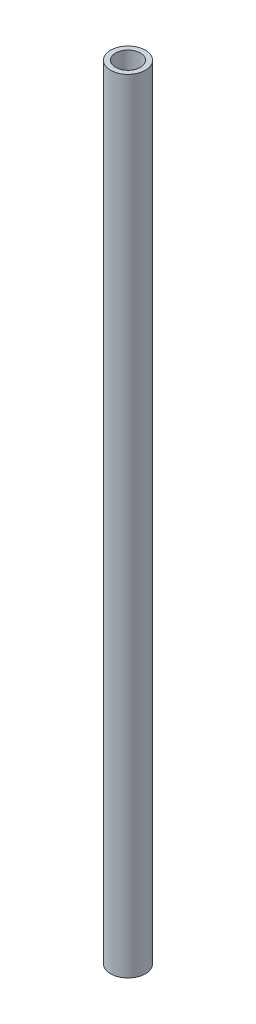
ISO-10303-21;
HEADER;
FILE_DESCRIPTION(('STEP AP214'),'2;1');
FILE_NAME('part.step','',(''),(''),'','','');
FILE_SCHEMA(('AUTOMOTIVE_DESIGN { 1 0 10303 214 1 1 1 1 }'));
ENDSEC;
DATA;
#1=APPLICATION_CONTEXT('core data for automotive mechanical design processes');
#2=APPLICATION_PROTOCOL_DEFINITION('international standard','automotive_design',2000,#1);
#3=PRODUCT_CONTEXT('',#1,'mechanical');
#4=PRODUCT('Part','Part','',(#3));
#5=PRODUCT_RELATED_PRODUCT_CATEGORY('part','',(#4));
#6=PRODUCT_DEFINITION_FORMATION('','',#4);
#7=PRODUCT_DEFINITION_CONTEXT('part definition',#1,'design');
#8=PRODUCT_DEFINITION('design','',#6,#7);
#9=PRODUCT_DEFINITION_SHAPE('','',#8);
#10=(LENGTH_UNIT() NAMED_UNIT(*) SI_UNIT(.MILLI.,.METRE.));
#11=(NAMED_UNIT(*) PLANE_ANGLE_UNIT() SI_UNIT($,.RADIAN.));
#12=(NAMED_UNIT(*) SI_UNIT($,.STERADIAN.) SOLID_ANGLE_UNIT());
#13=UNCERTAINTY_MEASURE_WITH_UNIT(LENGTH_MEASURE(1.E-05),#10,'distance_accuracy_value','');
#14=(GEOMETRIC_REPRESENTATION_CONTEXT(3) GLOBAL_UNCERTAINTY_ASSIGNED_CONTEXT((#13)) GLOBAL_UNIT_ASSIGNED_CONTEXT((#10,
#11,#12)) REPRESENTATION_CONTEXT('',''));
#15=CARTESIAN_POINT('',(0.,0.,0.));
#16=DIRECTION('',(0.,0.,1.));
#17=DIRECTION('',(1.,0.,0.));
#18=AXIS2_PLACEMENT_3D('',#15,#16,#17);
#19=CARTESIAN_POINT('',(0.,500.,0.));
#20=DIRECTION('',(0.,-1.,0.));
#21=DIRECTION('',(0.,0.,-1.));
#22=AXIS2_PLACEMENT_3D('',#19,#20,#21);
#23=CYLINDRICAL_SURFACE('',#22,15.875);
#24=CARTESIAN_POINT('',(0.,500.,0.));
#25=DIRECTION('',(0.,1.,0.));
#26=DIRECTION('',(0.,0.,1.));
#27=AXIS2_PLACEMENT_3D('',#24,#25,#26);
#28=CIRCLE('',#27,15.875);
#29=CARTESIAN_POINT('',(0.,500.,15.875));
#30=VERTEX_POINT('',#29);
#31=EDGE_CURVE('E49',#30,#30,#28,.T.);
#32=ORIENTED_EDGE('',*,*,#31,.T.);
#33=EDGE_LOOP('',(#32));
#34=FACE_BOUND('',#33,.T.);
#35=CARTESIAN_POINT('',(0.,-500.,0.));
#36=DIRECTION('',(0.,1.,0.));
#37=DIRECTION('',(0.,0.,1.));
#38=AXIS2_PLACEMENT_3D('',#35,#36,#37);
#39=CIRCLE('',#38,15.875);
#40=CARTESIAN_POINT('',(0.,-500.,15.875));
#41=VERTEX_POINT('',#40);
#42=EDGE_CURVE('E56',#41,#41,#39,.T.);
#43=ORIENTED_EDGE('',*,*,#42,.F.);
#44=EDGE_LOOP('',(#43));
#45=FACE_BOUND('',#44,.T.);
#46=ADVANCED_FACE('F41',(#34,#45),#23,.F.);
#47=CARTESIAN_POINT('',(0.,500.,0.));
#48=DIRECTION('',(0.,-1.,0.));
#49=DIRECTION('',(0.,0.,-1.));
#50=AXIS2_PLACEMENT_3D('',#47,#48,#49);
#51=CYLINDRICAL_SURFACE('',#50,22.225);
#52=CARTESIAN_POINT('',(0.,500.,0.));
#53=DIRECTION('',(0.,1.,0.));
#54=DIRECTION('',(0.,0.,1.));
#55=AXIS2_PLACEMENT_3D('',#52,#53,#54);
#56=CIRCLE('',#55,22.225);
#57=CARTESIAN_POINT('',(0.,500.,22.225));
#58=VERTEX_POINT('',#57);
#59=EDGE_CURVE('E10',#58,#58,#56,.T.);
#60=ORIENTED_EDGE('',*,*,#59,.F.);
#61=EDGE_LOOP('',(#60));
#62=FACE_BOUND('',#61,.T.);
#63=CARTESIAN_POINT('',(0.,-500.,0.));
#64=DIRECTION('',(0.,1.,0.));
#65=DIRECTION('',(0.,0.,1.));
#66=AXIS2_PLACEMENT_3D('',#63,#64,#65);
#67=CIRCLE('',#66,22.225);
#68=CARTESIAN_POINT('',(0.,-500.,22.225));
#69=VERTEX_POINT('',#68);
#70=EDGE_CURVE('E44',#69,#69,#67,.T.);
#71=ORIENTED_EDGE('',*,*,#70,.T.);
#72=EDGE_LOOP('',(#71));
#73=FACE_BOUND('',#72,.T.);
#74=ADVANCED_FACE('F65',(#62,#73),#51,.T.);
#75=CARTESIAN_POINT('',(0.,500.,0.));
#76=DIRECTION('',(0.,1.,0.));
#77=DIRECTION('',(0.,0.,1.));
#78=AXIS2_PLACEMENT_3D('',#75,#76,#77);
#79=PLANE('',#78);
#80=ORIENTED_EDGE('',*,*,#31,.F.);
#81=EDGE_LOOP('',(#80));
#82=FACE_BOUND('',#81,.T.);
#83=ORIENTED_EDGE('',*,*,#59,.T.);
#84=EDGE_LOOP('',(#83));
#85=FACE_BOUND('',#84,.T.);
#86=ADVANCED_FACE('F69',(#82,#85),#79,.T.);
#87=CARTESIAN_POINT('',(0.,-500.,0.));
#88=DIRECTION('',(0.,1.,0.));
#89=DIRECTION('',(0.,0.,1.));
#90=AXIS2_PLACEMENT_3D('',#87,#88,#89);
#91=PLANE('',#90);
#92=ORIENTED_EDGE('',*,*,#42,.T.);
#93=EDGE_LOOP('',(#92));
#94=FACE_BOUND('',#93,.T.);
#95=ORIENTED_EDGE('',*,*,#70,.F.);
#96=EDGE_LOOP('',(#95));
#97=FACE_BOUND('',#96,.T.);
#98=ADVANCED_FACE('F67',(#94,#97),#91,.F.);
#99=CLOSED_SHELL('',(#46,#74,#86,#98));
#100=MANIFOLD_SOLID_BREP('B2',#99);
#101=ADVANCED_BREP_SHAPE_REPRESENTATION('',(#18,#100),#14);
#102=SHAPE_DEFINITION_REPRESENTATION(#9,#101);
ENDSEC;
END-ISO-10303-21;
